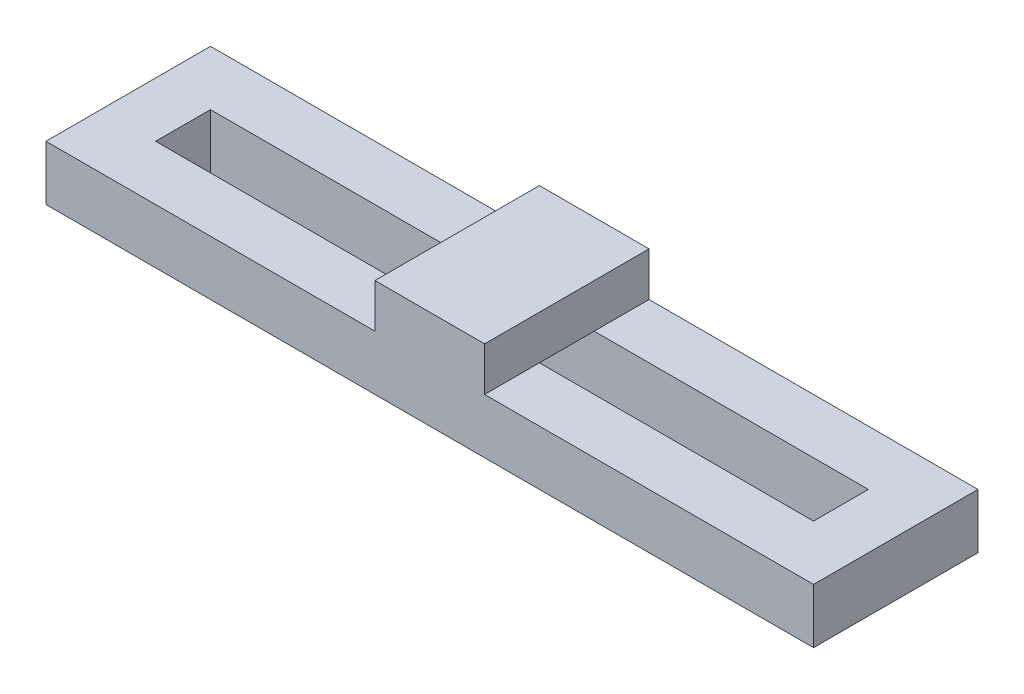
ISO-10303-21;
HEADER;
FILE_DESCRIPTION(('STEP AP214'),'2;1');
FILE_NAME('part.step','',(''),(''),'','','');
FILE_SCHEMA(('AUTOMOTIVE_DESIGN { 1 0 10303 214 1 1 1 1 }'));
ENDSEC;
DATA;
#1=APPLICATION_CONTEXT('core data for automotive mechanical design processes');
#2=APPLICATION_PROTOCOL_DEFINITION('international standard','automotive_design',2000,#1);
#3=PRODUCT_CONTEXT('',#1,'mechanical');
#4=PRODUCT('Part','Part','',(#3));
#5=PRODUCT_RELATED_PRODUCT_CATEGORY('part','',(#4));
#6=PRODUCT_DEFINITION_FORMATION('','',#4);
#7=PRODUCT_DEFINITION_CONTEXT('part definition',#1,'design');
#8=PRODUCT_DEFINITION('design','',#6,#7);
#9=PRODUCT_DEFINITION_SHAPE('','',#8);
#10=(LENGTH_UNIT() NAMED_UNIT(*) SI_UNIT(.MILLI.,.METRE.));
#11=(NAMED_UNIT(*) PLANE_ANGLE_UNIT() SI_UNIT($,.RADIAN.));
#12=(NAMED_UNIT(*) SI_UNIT($,.STERADIAN.) SOLID_ANGLE_UNIT());
#13=UNCERTAINTY_MEASURE_WITH_UNIT(LENGTH_MEASURE(1.E-05),#10,'distance_accuracy_value','');
#14=(GEOMETRIC_REPRESENTATION_CONTEXT(3) GLOBAL_UNCERTAINTY_ASSIGNED_CONTEXT((#13)) GLOBAL_UNIT_ASSIGNED_CONTEXT((#10,
#11,#12)) REPRESENTATION_CONTEXT('',''));
#15=CARTESIAN_POINT('',(0.,0.,0.));
#16=DIRECTION('',(0.,0.,1.));
#17=DIRECTION('',(1.,0.,0.));
#18=AXIS2_PLACEMENT_3D('',#15,#16,#17);
#19=CARTESIAN_POINT('',(0.,5.,0.));
#20=DIRECTION('',(0.,-1.,0.));
#21=DIRECTION('',(0.,0.,-1.));
#22=AXIS2_PLACEMENT_3D('',#19,#20,#21);
#23=PLANE('',#22);
#24=DIRECTION('',(0.,0.,-1.));
#25=VECTOR('',#24,1.);
#26=CARTESIAN_POINT('',(5.,5.,7.5));
#27=LINE('',#26,#25);
#28=CARTESIAN_POINT('',(5.,5.,7.5));
#29=VERTEX_POINT('',#28);
#30=CARTESIAN_POINT('',(5.,5.,2.49999999999999));
#31=VERTEX_POINT('',#30);
#32=EDGE_CURVE('E47',#29,#31,#27,.T.);
#33=ORIENTED_EDGE('',*,*,#32,.F.);
#34=DIRECTION('',(1.,0.,0.));
#35=VECTOR('',#34,1.);
#36=CARTESIAN_POINT('',(-35.,5.,7.5));
#37=LINE('',#36,#35);
#38=CARTESIAN_POINT('',(35.,5.,7.5));
#39=VERTEX_POINT('',#38);
#40=EDGE_CURVE('E216',#29,#39,#37,.T.);
#41=ORIENTED_EDGE('',*,*,#40,.T.);
#42=DIRECTION('',(0.,0.,-1.));
#43=VECTOR('',#42,1.);
#44=CARTESIAN_POINT('',(35.,5.,7.5));
#45=LINE('',#44,#43);
#46=CARTESIAN_POINT('',(35.,5.,-7.5));
#47=VERTEX_POINT('',#46);
#48=EDGE_CURVE('E207',#39,#47,#45,.T.);
#49=ORIENTED_EDGE('',*,*,#48,.T.);
#50=DIRECTION('',(-1.,0.,0.));
#51=VECTOR('',#50,1.);
#52=CARTESIAN_POINT('',(-35.,5.,-7.5));
#53=LINE('',#52,#51);
#54=CARTESIAN_POINT('',(5.,5.,-7.5));
#55=VERTEX_POINT('',#54);
#56=EDGE_CURVE('E212',#47,#55,#53,.T.);
#57=ORIENTED_EDGE('',*,*,#56,.T.);
#58=CARTESIAN_POINT('',(5.,5.,-2.50000000000001));
#59=VERTEX_POINT('',#58);
#60=EDGE_CURVE('E11',#59,#55,#27,.T.);
#61=ORIENTED_EDGE('',*,*,#60,.F.);
#62=DIRECTION('',(-1.,0.,0.));
#63=VECTOR('',#62,1.);
#64=CARTESIAN_POINT('',(30.,5.,-2.50000000000001));
#65=LINE('',#64,#63);
#66=CARTESIAN_POINT('',(30.,5.,-2.50000000000001));
#67=VERTEX_POINT('',#66);
#68=EDGE_CURVE('E185',#67,#59,#65,.T.);
#69=ORIENTED_EDGE('',*,*,#68,.F.);
#70=DIRECTION('',(0.,0.,-1.));
#71=VECTOR('',#70,1.);
#72=CARTESIAN_POINT('',(30.,5.,2.49999999999999));
#73=LINE('',#72,#71);
#74=CARTESIAN_POINT('',(30.,5.,2.49999999999999));
#75=VERTEX_POINT('',#74);
#76=EDGE_CURVE('E180',#75,#67,#73,.T.);
#77=ORIENTED_EDGE('',*,*,#76,.F.);
#78=DIRECTION('',(1.,0.,0.));
#79=VECTOR('',#78,1.);
#80=CARTESIAN_POINT('',(30.,5.,2.49999999999999));
#81=LINE('',#80,#79);
#82=EDGE_CURVE('E55',#31,#75,#81,.T.);
#83=ORIENTED_EDGE('',*,*,#82,.F.);
#84=EDGE_LOOP('',(#33,#41,#49,#57,#61,#69,#77,#83));
#85=FACE_BOUND('',#84,.T.);
#86=ADVANCED_FACE('F36',(#85),#23,.F.);
#87=DIRECTION('',(0.,0.,1.));
#88=VECTOR('',#87,1.);
#89=CARTESIAN_POINT('',(-5.,5.,7.5));
#90=LINE('',#89,#88);
#91=CARTESIAN_POINT('',(-5.,5.,-7.5));
#92=VERTEX_POINT('',#91);
#93=CARTESIAN_POINT('',(-5.,5.,-2.5));
#94=VERTEX_POINT('',#93);
#95=EDGE_CURVE('E161',#92,#94,#90,.T.);
#96=ORIENTED_EDGE('',*,*,#95,.F.);
#97=CARTESIAN_POINT('',(-35.,5.,-7.5));
#98=VERTEX_POINT('',#97);
#99=EDGE_CURVE('E210',#92,#98,#53,.T.);
#100=ORIENTED_EDGE('',*,*,#99,.T.);
#101=DIRECTION('',(0.,0.,1.));
#102=VECTOR('',#101,1.);
#103=CARTESIAN_POINT('',(-35.,5.,7.5));
#104=LINE('',#103,#102);
#105=CARTESIAN_POINT('',(-35.,5.,7.5));
#106=VERTEX_POINT('',#105);
#107=EDGE_CURVE('E214',#98,#106,#104,.T.);
#108=ORIENTED_EDGE('',*,*,#107,.T.);
#109=CARTESIAN_POINT('',(-5.,5.,7.5));
#110=VERTEX_POINT('',#109);
#111=EDGE_CURVE('E217',#106,#110,#37,.T.);
#112=ORIENTED_EDGE('',*,*,#111,.T.);
#113=CARTESIAN_POINT('',(-5.,5.,2.49999999999999));
#114=VERTEX_POINT('',#113);
#115=EDGE_CURVE('E45',#114,#110,#90,.T.);
#116=ORIENTED_EDGE('',*,*,#115,.F.);
#117=CARTESIAN_POINT('',(-30.,5.,2.5));
#118=VERTEX_POINT('',#117);
#119=EDGE_CURVE('E178',#118,#114,#81,.T.);
#120=ORIENTED_EDGE('',*,*,#119,.F.);
#121=DIRECTION('',(0.,0.,1.));
#122=VECTOR('',#121,1.);
#123=CARTESIAN_POINT('',(-30.,5.,2.5));
#124=LINE('',#123,#122);
#125=CARTESIAN_POINT('',(-30.,5.,-2.5));
#126=VERTEX_POINT('',#125);
#127=EDGE_CURVE('E175',#126,#118,#124,.T.);
#128=ORIENTED_EDGE('',*,*,#127,.F.);
#129=EDGE_CURVE('E184',#94,#126,#65,.T.);
#130=ORIENTED_EDGE('',*,*,#129,.F.);
#131=EDGE_LOOP('',(#96,#100,#108,#112,#116,#120,#128,#130));
#132=FACE_BOUND('',#131,.T.);
#133=ADVANCED_FACE('F266',(#132),#23,.F.);
#134=CARTESIAN_POINT('',(0.,0.,0.));
#135=DIRECTION('',(0.,-1.,0.));
#136=DIRECTION('',(0.,0.,-1.));
#137=AXIS2_PLACEMENT_3D('',#134,#135,#136);
#138=PLANE('',#137);
#139=DIRECTION('',(0.,0.,-1.));
#140=VECTOR('',#139,1.);
#141=CARTESIAN_POINT('',(35.,0.,7.5));
#142=LINE('',#141,#140);
#143=CARTESIAN_POINT('',(35.,0.,7.5));
#144=VERTEX_POINT('',#143);
#145=CARTESIAN_POINT('',(35.,0.,-7.5));
#146=VERTEX_POINT('',#145);
#147=EDGE_CURVE('E206',#144,#146,#142,.T.);
#148=ORIENTED_EDGE('',*,*,#147,.F.);
#149=DIRECTION('',(1.,0.,0.));
#150=VECTOR('',#149,1.);
#151=CARTESIAN_POINT('',(-35.,0.,7.5));
#152=LINE('',#151,#150);
#153=CARTESIAN_POINT('',(-35.,0.,7.5));
#154=VERTEX_POINT('',#153);
#155=EDGE_CURVE('E211',#154,#144,#152,.T.);
#156=ORIENTED_EDGE('',*,*,#155,.F.);
#157=DIRECTION('',(0.,0.,1.));
#158=VECTOR('',#157,1.);
#159=CARTESIAN_POINT('',(-35.,0.,7.5));
#160=LINE('',#159,#158);
#161=CARTESIAN_POINT('',(-35.,0.,-7.5));
#162=VERTEX_POINT('',#161);
#163=EDGE_CURVE('E224',#162,#154,#160,.T.);
#164=ORIENTED_EDGE('',*,*,#163,.F.);
#165=DIRECTION('',(-1.,0.,0.));
#166=VECTOR('',#165,1.);
#167=CARTESIAN_POINT('',(-35.,0.,-7.5));
#168=LINE('',#167,#166);
#169=EDGE_CURVE('E222',#146,#162,#168,.T.);
#170=ORIENTED_EDGE('',*,*,#169,.F.);
#171=EDGE_LOOP('',(#148,#156,#164,#170));
#172=FACE_BOUND('',#171,.T.);
#173=DIRECTION('',(-1.,0.,0.));
#174=VECTOR('',#173,1.);
#175=CARTESIAN_POINT('',(30.,0.,-2.50000000000001));
#176=LINE('',#175,#174);
#177=CARTESIAN_POINT('',(30.,0.,-2.50000000000001));
#178=VERTEX_POINT('',#177);
#179=CARTESIAN_POINT('',(-30.,0.,-2.5));
#180=VERTEX_POINT('',#179);
#181=EDGE_CURVE('E177',#178,#180,#176,.T.);
#182=ORIENTED_EDGE('',*,*,#181,.T.);
#183=DIRECTION('',(0.,0.,1.));
#184=VECTOR('',#183,1.);
#185=CARTESIAN_POINT('',(-30.,0.,2.5));
#186=LINE('',#185,#184);
#187=CARTESIAN_POINT('',(-30.,0.,2.5));
#188=VERTEX_POINT('',#187);
#189=EDGE_CURVE('E166',#180,#188,#186,.T.);
#190=ORIENTED_EDGE('',*,*,#189,.T.);
#191=DIRECTION('',(1.,0.,0.));
#192=VECTOR('',#191,1.);
#193=CARTESIAN_POINT('',(30.,0.,2.49999999999999));
#194=LINE('',#193,#192);
#195=CARTESIAN_POINT('',(30.,0.,2.49999999999999));
#196=VERTEX_POINT('',#195);
#197=EDGE_CURVE('E169',#188,#196,#194,.T.);
#198=ORIENTED_EDGE('',*,*,#197,.T.);
#199=DIRECTION('',(0.,0.,-1.));
#200=VECTOR('',#199,1.);
#201=CARTESIAN_POINT('',(30.,0.,2.49999999999999));
#202=LINE('',#201,#200);
#203=EDGE_CURVE('E192',#196,#178,#202,.T.);
#204=ORIENTED_EDGE('',*,*,#203,.T.);
#205=EDGE_LOOP('',(#182,#190,#198,#204));
#206=FACE_BOUND('',#205,.T.);
#207=ADVANCED_FACE('F262',(#172,#206),#138,.T.);
#208=CARTESIAN_POINT('',(35.,5.,7.5));
#209=DIRECTION('',(-1.,0.,0.));
#210=DIRECTION('',(0.,0.,1.));
#211=AXIS2_PLACEMENT_3D('',#208,#209,#210);
#212=PLANE('',#211);
#213=ORIENTED_EDGE('',*,*,#147,.T.);
#214=DIRECTION('',(0.,-1.,0.));
#215=VECTOR('',#214,1.);
#216=CARTESIAN_POINT('',(35.,5.,-7.5));
#217=LINE('',#216,#215);
#218=EDGE_CURVE('E40',#47,#146,#217,.T.);
#219=ORIENTED_EDGE('',*,*,#218,.F.);
#220=ORIENTED_EDGE('',*,*,#48,.F.);
#221=DIRECTION('',(0.,-1.,0.));
#222=VECTOR('',#221,1.);
#223=CARTESIAN_POINT('',(35.,5.,7.5));
#224=LINE('',#223,#222);
#225=EDGE_CURVE('E219',#39,#144,#224,.T.);
#226=ORIENTED_EDGE('',*,*,#225,.T.);
#227=EDGE_LOOP('',(#213,#219,#220,#226));
#228=FACE_BOUND('',#227,.T.);
#229=ADVANCED_FACE('F38',(#228),#212,.F.);
#230=CARTESIAN_POINT('',(-35.,5.,-7.5));
#231=DIRECTION('',(0.,0.,1.));
#232=DIRECTION('',(1.,0.,0.));
#233=AXIS2_PLACEMENT_3D('',#230,#231,#232);
#234=PLANE('',#233);
#235=ORIENTED_EDGE('',*,*,#169,.T.);
#236=DIRECTION('',(0.,-1.,0.));
#237=VECTOR('',#236,1.);
#238=CARTESIAN_POINT('',(-35.,5.,-7.5));
#239=LINE('',#238,#237);
#240=EDGE_CURVE('E231',#98,#162,#239,.T.);
#241=ORIENTED_EDGE('',*,*,#240,.F.);
#242=ORIENTED_EDGE('',*,*,#99,.F.);
#243=DIRECTION('',(0.,-1.,0.));
#244=VECTOR('',#243,1.);
#245=CARTESIAN_POINT('',(-5.,9.,-7.5));
#246=LINE('',#245,#244);
#247=CARTESIAN_POINT('',(-5.,9.,-7.5));
#248=VERTEX_POINT('',#247);
#249=EDGE_CURVE('E148',#248,#92,#246,.T.);
#250=ORIENTED_EDGE('',*,*,#249,.F.);
#251=DIRECTION('',(-1.,0.,0.));
#252=VECTOR('',#251,1.);
#253=CARTESIAN_POINT('',(-5.,9.,-7.5));
#254=LINE('',#253,#252);
#255=CARTESIAN_POINT('',(5.,9.,-7.5));
#256=VERTEX_POINT('',#255);
#257=EDGE_CURVE('E141',#256,#248,#254,.T.);
#258=ORIENTED_EDGE('',*,*,#257,.F.);
#259=DIRECTION('',(0.,-1.,0.));
#260=VECTOR('',#259,1.);
#261=CARTESIAN_POINT('',(5.,9.,-7.5));
#262=LINE('',#261,#260);
#263=EDGE_CURVE('E145',#256,#55,#262,.T.);
#264=ORIENTED_EDGE('',*,*,#263,.T.);
#265=ORIENTED_EDGE('',*,*,#56,.F.);
#266=ORIENTED_EDGE('',*,*,#218,.T.);
#267=EDGE_LOOP('',(#235,#241,#242,#250,#258,#264,#265,#266));
#268=FACE_BOUND('',#267,.T.);
#269=ADVANCED_FACE('F143',(#268),#234,.F.);
#270=CARTESIAN_POINT('',(-35.,5.,7.5));
#271=DIRECTION('',(1.,0.,0.));
#272=DIRECTION('',(0.,0.,-1.));
#273=AXIS2_PLACEMENT_3D('',#270,#271,#272);
#274=PLANE('',#273);
#275=ORIENTED_EDGE('',*,*,#163,.T.);
#276=DIRECTION('',(0.,-1.,0.));
#277=VECTOR('',#276,1.);
#278=CARTESIAN_POINT('',(-35.,5.,7.5));
#279=LINE('',#278,#277);
#280=EDGE_CURVE('E229',#106,#154,#279,.T.);
#281=ORIENTED_EDGE('',*,*,#280,.F.);
#282=ORIENTED_EDGE('',*,*,#107,.F.);
#283=ORIENTED_EDGE('',*,*,#240,.T.);
#284=EDGE_LOOP('',(#275,#281,#282,#283));
#285=FACE_BOUND('',#284,.T.);
#286=ADVANCED_FACE('F265',(#285),#274,.F.);
#287=CARTESIAN_POINT('',(-35.,5.,7.5));
#288=DIRECTION('',(0.,0.,-1.));
#289=DIRECTION('',(-1.,0.,0.));
#290=AXIS2_PLACEMENT_3D('',#287,#288,#289);
#291=PLANE('',#290);
#292=ORIENTED_EDGE('',*,*,#155,.T.);
#293=ORIENTED_EDGE('',*,*,#225,.F.);
#294=ORIENTED_EDGE('',*,*,#40,.F.);
#295=DIRECTION('',(0.,-1.,0.));
#296=VECTOR('',#295,1.);
#297=CARTESIAN_POINT('',(5.,9.,7.5));
#298=LINE('',#297,#296);
#299=CARTESIAN_POINT('',(5.,9.,7.5));
#300=VERTEX_POINT('',#299);
#301=EDGE_CURVE('E250',#300,#29,#298,.T.);
#302=ORIENTED_EDGE('',*,*,#301,.F.);
#303=DIRECTION('',(1.,0.,0.));
#304=VECTOR('',#303,1.);
#305=CARTESIAN_POINT('',(-5.,9.,7.5));
#306=LINE('',#305,#304);
#307=CARTESIAN_POINT('',(-5.,9.,7.5));
#308=VERTEX_POINT('',#307);
#309=EDGE_CURVE('E157',#308,#300,#306,.T.);
#310=ORIENTED_EDGE('',*,*,#309,.F.);
#311=DIRECTION('',(0.,-1.,0.));
#312=VECTOR('',#311,1.);
#313=CARTESIAN_POINT('',(-5.,9.,7.5));
#314=LINE('',#313,#312);
#315=EDGE_CURVE('E171',#308,#110,#314,.T.);
#316=ORIENTED_EDGE('',*,*,#315,.T.);
#317=ORIENTED_EDGE('',*,*,#111,.F.);
#318=ORIENTED_EDGE('',*,*,#280,.T.);
#319=EDGE_LOOP('',(#292,#293,#294,#302,#310,#316,#317,#318));
#320=FACE_BOUND('',#319,.T.);
#321=ADVANCED_FACE('F254',(#320),#291,.F.);
#322=CARTESIAN_POINT('',(-30.,5.,2.5));
#323=DIRECTION('',(1.,0.,0.));
#324=DIRECTION('',(0.,0.,-1.));
#325=AXIS2_PLACEMENT_3D('',#322,#323,#324);
#326=PLANE('',#325);
#327=ORIENTED_EDGE('',*,*,#189,.F.);
#328=DIRECTION('',(0.,-1.,0.));
#329=VECTOR('',#328,1.);
#330=CARTESIAN_POINT('',(-30.,5.,-2.5));
#331=LINE('',#330,#329);
#332=EDGE_CURVE('E187',#126,#180,#331,.T.);
#333=ORIENTED_EDGE('',*,*,#332,.F.);
#334=ORIENTED_EDGE('',*,*,#127,.T.);
#335=DIRECTION('',(0.,-1.,0.));
#336=VECTOR('',#335,1.);
#337=CARTESIAN_POINT('',(-30.,5.,2.5));
#338=LINE('',#337,#336);
#339=EDGE_CURVE('E203',#118,#188,#338,.T.);
#340=ORIENTED_EDGE('',*,*,#339,.T.);
#341=EDGE_LOOP('',(#327,#333,#334,#340));
#342=FACE_BOUND('',#341,.T.);
#343=ADVANCED_FACE('F287',(#342),#326,.T.);
#344=CARTESIAN_POINT('',(30.,5.,2.49999999999999));
#345=DIRECTION('',(0.,0.,-1.));
#346=DIRECTION('',(-1.,0.,0.));
#347=AXIS2_PLACEMENT_3D('',#344,#345,#346);
#348=PLANE('',#347);
#349=ORIENTED_EDGE('',*,*,#197,.F.);
#350=ORIENTED_EDGE('',*,*,#339,.F.);
#351=ORIENTED_EDGE('',*,*,#119,.T.);
#352=EDGE_CURVE('E181',#114,#31,#81,.T.);
#353=ORIENTED_EDGE('',*,*,#352,.T.);
#354=ORIENTED_EDGE('',*,*,#82,.T.);
#355=DIRECTION('',(0.,-1.,0.));
#356=VECTOR('',#355,1.);
#357=CARTESIAN_POINT('',(30.,5.,2.49999999999999));
#358=LINE('',#357,#356);
#359=EDGE_CURVE('E201',#75,#196,#358,.T.);
#360=ORIENTED_EDGE('',*,*,#359,.T.);
#361=EDGE_LOOP('',(#349,#350,#351,#353,#354,#360));
#362=FACE_BOUND('',#361,.T.);
#363=ADVANCED_FACE('F278',(#362),#348,.T.);
#364=CARTESIAN_POINT('',(30.,5.,2.49999999999999));
#365=DIRECTION('',(-1.,0.,0.));
#366=DIRECTION('',(0.,0.,1.));
#367=AXIS2_PLACEMENT_3D('',#364,#365,#366);
#368=PLANE('',#367);
#369=ORIENTED_EDGE('',*,*,#203,.F.);
#370=ORIENTED_EDGE('',*,*,#359,.F.);
#371=ORIENTED_EDGE('',*,*,#76,.T.);
#372=DIRECTION('',(0.,-1.,0.));
#373=VECTOR('',#372,1.);
#374=CARTESIAN_POINT('',(30.,5.,-2.50000000000001));
#375=LINE('',#374,#373);
#376=EDGE_CURVE('E199',#67,#178,#375,.T.);
#377=ORIENTED_EDGE('',*,*,#376,.T.);
#378=EDGE_LOOP('',(#369,#370,#371,#377));
#379=FACE_BOUND('',#378,.T.);
#380=ADVANCED_FACE('F281',(#379),#368,.T.);
#381=CARTESIAN_POINT('',(30.,5.,-2.50000000000001));
#382=DIRECTION('',(0.,0.,1.));
#383=DIRECTION('',(1.,0.,0.));
#384=AXIS2_PLACEMENT_3D('',#381,#382,#383);
#385=PLANE('',#384);
#386=ORIENTED_EDGE('',*,*,#181,.F.);
#387=ORIENTED_EDGE('',*,*,#376,.F.);
#388=ORIENTED_EDGE('',*,*,#68,.T.);
#389=EDGE_CURVE('E188',#59,#94,#65,.T.);
#390=ORIENTED_EDGE('',*,*,#389,.T.);
#391=ORIENTED_EDGE('',*,*,#129,.T.);
#392=ORIENTED_EDGE('',*,*,#332,.T.);
#393=EDGE_LOOP('',(#386,#387,#388,#390,#391,#392));
#394=FACE_BOUND('',#393,.T.);
#395=ADVANCED_FACE('F284',(#394),#385,.T.);
#396=CARTESIAN_POINT('',(0.,5.,0.));
#397=DIRECTION('',(0.,-1.,0.));
#398=DIRECTION('',(0.,0.,-1.));
#399=AXIS2_PLACEMENT_3D('',#396,#397,#398);
#400=PLANE('',#399);
#401=ORIENTED_EDGE('',*,*,#389,.F.);
#402=EDGE_CURVE('E48',#31,#59,#27,.T.);
#403=ORIENTED_EDGE('',*,*,#402,.F.);
#404=ORIENTED_EDGE('',*,*,#352,.F.);
#405=EDGE_CURVE('E240',#94,#114,#90,.T.);
#406=ORIENTED_EDGE('',*,*,#405,.F.);
#407=EDGE_LOOP('',(#401,#403,#404,#406));
#408=FACE_BOUND('',#407,.T.);
#409=ADVANCED_FACE('F274',(#408),#400,.T.);
#410=CARTESIAN_POINT('',(5.,9.,7.5));
#411=DIRECTION('',(-1.,0.,0.));
#412=DIRECTION('',(0.,0.,1.));
#413=AXIS2_PLACEMENT_3D('',#410,#411,#412);
#414=PLANE('',#413);
#415=ORIENTED_EDGE('',*,*,#32,.T.);
#416=ORIENTED_EDGE('',*,*,#402,.T.);
#417=ORIENTED_EDGE('',*,*,#60,.T.);
#418=ORIENTED_EDGE('',*,*,#263,.F.);
#419=DIRECTION('',(0.,0.,-1.));
#420=VECTOR('',#419,1.);
#421=CARTESIAN_POINT('',(5.,9.,7.5));
#422=LINE('',#421,#420);
#423=EDGE_CURVE('E152',#300,#256,#422,.T.);
#424=ORIENTED_EDGE('',*,*,#423,.F.);
#425=ORIENTED_EDGE('',*,*,#301,.T.);
#426=EDGE_LOOP('',(#415,#416,#417,#418,#424,#425));
#427=FACE_BOUND('',#426,.T.);
#428=ADVANCED_FACE('F164',(#427),#414,.F.);
#429=CARTESIAN_POINT('',(-5.,9.,7.5));
#430=DIRECTION('',(1.,0.,0.));
#431=DIRECTION('',(0.,0.,-1.));
#432=AXIS2_PLACEMENT_3D('',#429,#430,#431);
#433=PLANE('',#432);
#434=ORIENTED_EDGE('',*,*,#95,.T.);
#435=ORIENTED_EDGE('',*,*,#405,.T.);
#436=ORIENTED_EDGE('',*,*,#115,.T.);
#437=ORIENTED_EDGE('',*,*,#315,.F.);
#438=DIRECTION('',(0.,0.,1.));
#439=VECTOR('',#438,1.);
#440=CARTESIAN_POINT('',(-5.,9.,7.5));
#441=LINE('',#440,#439);
#442=EDGE_CURVE('E151',#248,#308,#441,.T.);
#443=ORIENTED_EDGE('',*,*,#442,.F.);
#444=ORIENTED_EDGE('',*,*,#249,.T.);
#445=EDGE_LOOP('',(#434,#435,#436,#437,#443,#444));
#446=FACE_BOUND('',#445,.T.);
#447=ADVANCED_FACE('F251',(#446),#433,.F.);
#448=CARTESIAN_POINT('',(0.,9.,0.));
#449=DIRECTION('',(0.,-1.,0.));
#450=DIRECTION('',(0.,0.,-1.));
#451=AXIS2_PLACEMENT_3D('',#448,#449,#450);
#452=PLANE('',#451);
#453=ORIENTED_EDGE('',*,*,#423,.T.);
#454=ORIENTED_EDGE('',*,*,#257,.T.);
#455=ORIENTED_EDGE('',*,*,#442,.T.);
#456=ORIENTED_EDGE('',*,*,#309,.T.);
#457=EDGE_LOOP('',(#453,#454,#455,#456));
#458=FACE_BOUND('',#457,.T.);
#459=ADVANCED_FACE('F155',(#458),#452,.F.);
#460=CLOSED_SHELL('',(#86,#133,#207,#229,#269,#286,#321,#343,#363,#380,#395,#409,#428,#447,#459));
#461=MANIFOLD_SOLID_BREP('B2',#460);
#462=ADVANCED_BREP_SHAPE_REPRESENTATION('',(#18,#461),#14);
#463=SHAPE_DEFINITION_REPRESENTATION(#9,#462);
ENDSEC;
END-ISO-10303-21;
